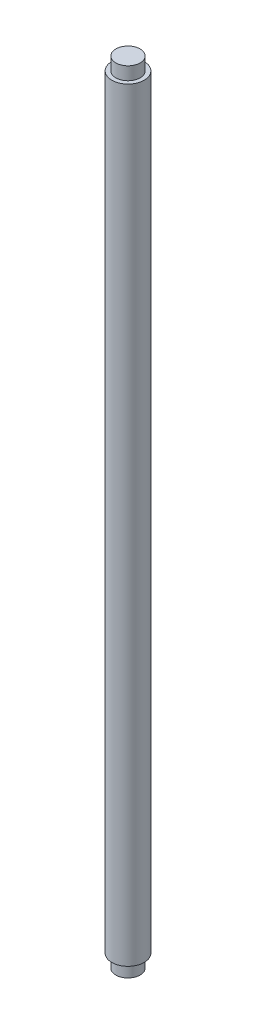
ISO-10303-21;
HEADER;
FILE_DESCRIPTION(('STEP AP214'),'2;1');
FILE_NAME('part.step','',(''),(''),'','','');
FILE_SCHEMA(('AUTOMOTIVE_DESIGN { 1 0 10303 214 1 1 1 1 }'));
ENDSEC;
DATA;
#1=APPLICATION_CONTEXT('core data for automotive mechanical design processes');
#2=APPLICATION_PROTOCOL_DEFINITION('international standard','automotive_design',2000,#1);
#3=PRODUCT_CONTEXT('',#1,'mechanical');
#4=PRODUCT('Part','Part','',(#3));
#5=PRODUCT_RELATED_PRODUCT_CATEGORY('part','',(#4));
#6=PRODUCT_DEFINITION_FORMATION('','',#4);
#7=PRODUCT_DEFINITION_CONTEXT('part definition',#1,'design');
#8=PRODUCT_DEFINITION('design','',#6,#7);
#9=PRODUCT_DEFINITION_SHAPE('','',#8);
#10=(LENGTH_UNIT() NAMED_UNIT(*) SI_UNIT(.MILLI.,.METRE.));
#11=(NAMED_UNIT(*) PLANE_ANGLE_UNIT() SI_UNIT($,.RADIAN.));
#12=(NAMED_UNIT(*) SI_UNIT($,.STERADIAN.) SOLID_ANGLE_UNIT());
#13=UNCERTAINTY_MEASURE_WITH_UNIT(LENGTH_MEASURE(1.E-05),#10,'distance_accuracy_value','');
#14=(GEOMETRIC_REPRESENTATION_CONTEXT(3) GLOBAL_UNCERTAINTY_ASSIGNED_CONTEXT((#13)) GLOBAL_UNIT_ASSIGNED_CONTEXT((#10,
#11,#12)) REPRESENTATION_CONTEXT('',''));
#15=CARTESIAN_POINT('',(0.,0.,0.));
#16=DIRECTION('',(0.,0.,1.));
#17=DIRECTION('',(1.,0.,0.));
#18=AXIS2_PLACEMENT_3D('',#15,#16,#17);
#19=CARTESIAN_POINT('',(0.,118.,0.));
#20=DIRECTION('',(0.,-1.,0.));
#21=DIRECTION('',(0.,0.,-1.));
#22=AXIS2_PLACEMENT_3D('',#19,#20,#21);
#23=CYLINDRICAL_SURFACE('',#22,2.5);
#24=CARTESIAN_POINT('',(0.,118.,0.));
#25=DIRECTION('',(0.,1.,0.));
#26=DIRECTION('',(0.,0.,1.));
#27=AXIS2_PLACEMENT_3D('',#24,#25,#26);
#28=CIRCLE('',#27,2.5);
#29=CARTESIAN_POINT('',(0.,118.,2.5));
#30=VERTEX_POINT('',#29);
#31=EDGE_CURVE('E47',#30,#30,#28,.T.);
#32=ORIENTED_EDGE('',*,*,#31,.F.);
#33=EDGE_LOOP('',(#32));
#34=FACE_BOUND('',#33,.T.);
#35=CARTESIAN_POINT('',(0.,0.,0.));
#36=DIRECTION('',(0.,1.,0.));
#37=DIRECTION('',(0.,0.,1.));
#38=AXIS2_PLACEMENT_3D('',#35,#36,#37);
#39=CIRCLE('',#38,2.5);
#40=CARTESIAN_POINT('',(0.,0.,2.5));
#41=VERTEX_POINT('',#40);
#42=EDGE_CURVE('E38',#41,#41,#39,.T.);
#43=ORIENTED_EDGE('',*,*,#42,.T.);
#44=EDGE_LOOP('',(#43));
#45=FACE_BOUND('',#44,.T.);
#46=ADVANCED_FACE('F35',(#34,#45),#23,.T.);
#47=CARTESIAN_POINT('',(0.,118.,0.));
#48=DIRECTION('',(0.,1.,0.));
#49=DIRECTION('',(0.,0.,1.));
#50=AXIS2_PLACEMENT_3D('',#47,#48,#49);
#51=PLANE('',#50);
#52=CARTESIAN_POINT('',(0.,118.,0.));
#53=DIRECTION('',(0.,1.,0.));
#54=DIRECTION('',(0.,0.,1.));
#55=AXIS2_PLACEMENT_3D('',#52,#53,#54);
#56=CIRCLE('',#55,1.875);
#57=CARTESIAN_POINT('',(0.,118.,1.875));
#58=VERTEX_POINT('',#57);
#59=EDGE_CURVE('E42',#58,#58,#56,.T.);
#60=ORIENTED_EDGE('',*,*,#59,.F.);
#61=EDGE_LOOP('',(#60));
#62=FACE_BOUND('',#61,.T.);
#63=ORIENTED_EDGE('',*,*,#31,.T.);
#64=EDGE_LOOP('',(#63));
#65=FACE_BOUND('',#64,.T.);
#66=ADVANCED_FACE('F64',(#62,#65),#51,.T.);
#67=CARTESIAN_POINT('',(0.,0.,0.));
#68=DIRECTION('',(0.,1.,0.));
#69=DIRECTION('',(0.,0.,1.));
#70=AXIS2_PLACEMENT_3D('',#67,#68,#69);
#71=PLANE('',#70);
#72=CARTESIAN_POINT('',(0.,0.,0.));
#73=DIRECTION('',(0.,-1.,0.));
#74=DIRECTION('',(0.,0.,-1.));
#75=AXIS2_PLACEMENT_3D('',#72,#73,#74);
#76=CIRCLE('',#75,1.875);
#77=CARTESIAN_POINT('',(0.,0.,-1.875));
#78=VERTEX_POINT('',#77);
#79=EDGE_CURVE('E10',#78,#78,#76,.T.);
#80=ORIENTED_EDGE('',*,*,#79,.F.);
#81=EDGE_LOOP('',(#80));
#82=FACE_BOUND('',#81,.T.);
#83=ORIENTED_EDGE('',*,*,#42,.F.);
#84=EDGE_LOOP('',(#83));
#85=FACE_BOUND('',#84,.T.);
#86=ADVANCED_FACE('F61',(#82,#85),#71,.F.);
#87=CARTESIAN_POINT('',(0.,120.,0.));
#88=DIRECTION('',(0.,-1.,0.));
#89=DIRECTION('',(0.,0.,-1.));
#90=AXIS2_PLACEMENT_3D('',#87,#88,#89);
#91=CYLINDRICAL_SURFACE('',#90,1.875);
#92=CARTESIAN_POINT('',(0.,120.,0.));
#93=DIRECTION('',(0.,1.,0.));
#94=DIRECTION('',(0.,0.,1.));
#95=AXIS2_PLACEMENT_3D('',#92,#93,#94);
#96=CIRCLE('',#95,1.875);
#97=CARTESIAN_POINT('',(0.,120.,1.875));
#98=VERTEX_POINT('',#97);
#99=EDGE_CURVE('E52',#98,#98,#96,.T.);
#100=ORIENTED_EDGE('',*,*,#99,.F.);
#101=EDGE_LOOP('',(#100));
#102=FACE_BOUND('',#101,.T.);
#103=ORIENTED_EDGE('',*,*,#59,.T.);
#104=EDGE_LOOP('',(#103));
#105=FACE_BOUND('',#104,.T.);
#106=ADVANCED_FACE('F63',(#102,#105),#91,.T.);
#107=CARTESIAN_POINT('',(0.,120.,0.));
#108=DIRECTION('',(0.,1.,0.));
#109=DIRECTION('',(0.,0.,1.));
#110=AXIS2_PLACEMENT_3D('',#107,#108,#109);
#111=PLANE('',#110);
#112=ORIENTED_EDGE('',*,*,#99,.T.);
#113=EDGE_LOOP('',(#112));
#114=FACE_BOUND('',#113,.T.);
#115=ADVANCED_FACE('F70',(#114),#111,.T.);
#116=CARTESIAN_POINT('',(0.,-2.,0.));
#117=DIRECTION('',(0.,1.,0.));
#118=DIRECTION('',(0.,0.,1.));
#119=AXIS2_PLACEMENT_3D('',#116,#117,#118);
#120=CYLINDRICAL_SURFACE('',#119,1.875);
#121=CARTESIAN_POINT('',(0.,-2.,0.));
#122=DIRECTION('',(0.,-1.,0.));
#123=DIRECTION('',(0.,0.,-1.));
#124=AXIS2_PLACEMENT_3D('',#121,#122,#123);
#125=CIRCLE('',#124,1.875);
#126=CARTESIAN_POINT('',(0.,-2.,-1.875));
#127=VERTEX_POINT('',#126);
#128=EDGE_CURVE('E51',#127,#127,#125,.T.);
#129=ORIENTED_EDGE('',*,*,#128,.F.);
#130=EDGE_LOOP('',(#129));
#131=FACE_BOUND('',#130,.T.);
#132=ORIENTED_EDGE('',*,*,#79,.T.);
#133=EDGE_LOOP('',(#132));
#134=FACE_BOUND('',#133,.T.);
#135=ADVANCED_FACE('F100',(#131,#134),#120,.T.);
#136=CARTESIAN_POINT('',(0.,-2.,0.));
#137=DIRECTION('',(0.,-1.,0.));
#138=DIRECTION('',(0.,0.,-1.));
#139=AXIS2_PLACEMENT_3D('',#136,#137,#138);
#140=PLANE('',#139);
#141=ORIENTED_EDGE('',*,*,#128,.T.);
#142=EDGE_LOOP('',(#141));
#143=FACE_BOUND('',#142,.T.);
#144=ADVANCED_FACE('F116',(#143),#140,.T.);
#145=CLOSED_SHELL('',(#46,#66,#86,#106,#115,#135,#144));
#146=MANIFOLD_SOLID_BREP('B2',#145);
#147=ADVANCED_BREP_SHAPE_REPRESENTATION('',(#18,#146),#14);
#148=SHAPE_DEFINITION_REPRESENTATION(#9,#147);
ENDSEC;
END-ISO-10303-21;
